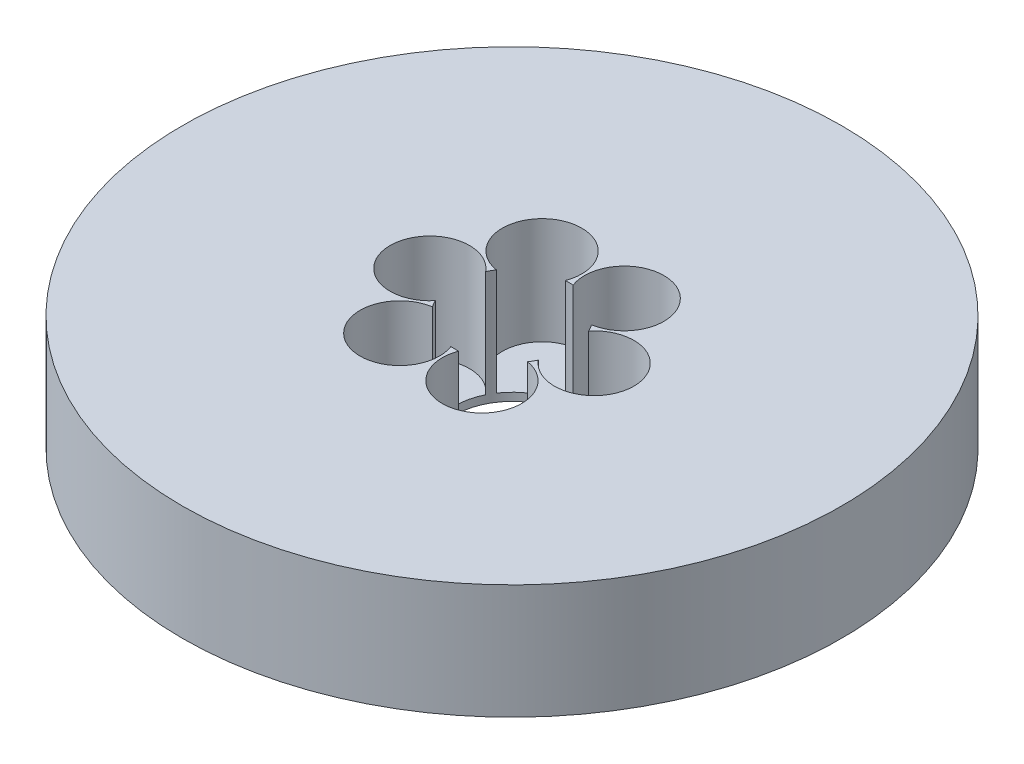
ISO-10303-21;
HEADER;
FILE_DESCRIPTION(('STEP AP214'),'2;1');
FILE_NAME('part.step','',(''),(''),'','','');
FILE_SCHEMA(('AUTOMOTIVE_DESIGN { 1 0 10303 214 1 1 1 1 }'));
ENDSEC;
DATA;
#1=APPLICATION_CONTEXT('core data for automotive mechanical design processes');
#2=APPLICATION_PROTOCOL_DEFINITION('international standard','automotive_design',2000,#1);
#3=PRODUCT_CONTEXT('',#1,'mechanical');
#4=PRODUCT('Part','Part','',(#3));
#5=PRODUCT_RELATED_PRODUCT_CATEGORY('part','',(#4));
#6=PRODUCT_DEFINITION_FORMATION('','',#4);
#7=PRODUCT_DEFINITION_CONTEXT('part definition',#1,'design');
#8=PRODUCT_DEFINITION('design','',#6,#7);
#9=PRODUCT_DEFINITION_SHAPE('','',#8);
#10=(LENGTH_UNIT() NAMED_UNIT(*) SI_UNIT(.MILLI.,.METRE.));
#11=(NAMED_UNIT(*) PLANE_ANGLE_UNIT() SI_UNIT($,.RADIAN.));
#12=(NAMED_UNIT(*) SI_UNIT($,.STERADIAN.) SOLID_ANGLE_UNIT());
#13=UNCERTAINTY_MEASURE_WITH_UNIT(LENGTH_MEASURE(1.E-05),#10,'distance_accuracy_value','');
#14=(GEOMETRIC_REPRESENTATION_CONTEXT(3) GLOBAL_UNCERTAINTY_ASSIGNED_CONTEXT((#13)) GLOBAL_UNIT_ASSIGNED_CONTEXT((#10,
#11,#12)) REPRESENTATION_CONTEXT('',''));
#15=CARTESIAN_POINT('',(0.,0.,0.));
#16=DIRECTION('',(0.,0.,1.));
#17=DIRECTION('',(1.,0.,0.));
#18=AXIS2_PLACEMENT_3D('',#15,#16,#17);
#19=CARTESIAN_POINT('',(0.,20.,0.));
#20=DIRECTION('',(0.,-1.,0.));
#21=DIRECTION('',(0.,0.,-1.));
#22=AXIS2_PLACEMENT_3D('',#19,#20,#21);
#23=CYLINDRICAL_SURFACE('',#22,57.5);
#24=CARTESIAN_POINT('',(0.,20.,0.));
#25=DIRECTION('',(0.,1.,0.));
#26=DIRECTION('',(0.,0.,1.));
#27=AXIS2_PLACEMENT_3D('',#24,#25,#26);
#28=CIRCLE('',#27,57.5);
#29=CARTESIAN_POINT('',(0.,20.,57.5));
#30=VERTEX_POINT('',#29);
#31=EDGE_CURVE('E168',#30,#30,#28,.T.);
#32=ORIENTED_EDGE('',*,*,#31,.F.);
#33=EDGE_LOOP('',(#32));
#34=FACE_BOUND('',#33,.T.);
#35=CARTESIAN_POINT('',(0.,0.,0.));
#36=DIRECTION('',(0.,1.,0.));
#37=DIRECTION('',(0.,0.,1.));
#38=AXIS2_PLACEMENT_3D('',#35,#36,#37);
#39=CIRCLE('',#38,57.5);
#40=CARTESIAN_POINT('',(0.,0.,57.5));
#41=VERTEX_POINT('',#40);
#42=EDGE_CURVE('E158',#41,#41,#39,.T.);
#43=ORIENTED_EDGE('',*,*,#42,.T.);
#44=EDGE_LOOP('',(#43));
#45=FACE_BOUND('',#44,.T.);
#46=ADVANCED_FACE('F39',(#34,#45),#23,.T.);
#47=CARTESIAN_POINT('',(0.,20.,0.));
#48=DIRECTION('',(0.,1.,0.));
#49=DIRECTION('',(0.,0.,1.));
#50=AXIS2_PLACEMENT_3D('',#47,#48,#49);
#51=PLANE('',#50);
#52=CARTESIAN_POINT('',(14.3354619955634,20.,0.));
#53=DIRECTION('',(0.,1.,0.));
#54=DIRECTION('',(0.,0.,-1.));
#55=AXIS2_PLACEMENT_3D('',#52,#53,#54);
#56=CIRCLE('',#55,6.92812453102638);
#57=CARTESIAN_POINT('',(8.98145316797351,20.,4.39698749048693));
#58=VERTEX_POINT('',#57);
#59=CARTESIAN_POINT('',(8.98145316797351,20.,-4.39698749048693));
#60=VERTEX_POINT('',#59);
#61=EDGE_CURVE('E212',#58,#60,#56,.T.);
#62=ORIENTED_EDGE('',*,*,#61,.F.);
#63=CARTESIAN_POINT('',(0.,20.,0.));
#64=DIRECTION('',(0.,1.,0.));
#65=DIRECTION('',(0.,0.,1.));
#66=AXIS2_PLACEMENT_3D('',#63,#64,#65);
#67=CIRCLE('',#66,10.);
#68=CARTESIAN_POINT('',(8.29862945087085,20.,5.57967286112178));
#69=VERTEX_POINT('',#68);
#70=EDGE_CURVE('E156',#69,#58,#67,.T.);
#71=ORIENTED_EDGE('',*,*,#70,.F.);
#72=CARTESIAN_POINT('',(7.16773099778178,20.,12.4148742631443));
#73=DIRECTION('',(0.,1.,0.));
#74=DIRECTION('',(0.866025403784436,0.,-0.500000000000004));
#75=AXIS2_PLACEMENT_3D('',#72,#73,#74);
#76=CIRCLE('',#75,6.92812453102638);
#77=CARTESIAN_POINT('',(0.682823717102737,20.,9.97666035160875));
#78=VERTEX_POINT('',#77);
#79=EDGE_CURVE('E152',#78,#69,#76,.T.);
#80=ORIENTED_EDGE('',*,*,#79,.F.);
#81=CARTESIAN_POINT('',(-0.682823717102664,20.,9.97666035160875));
#82=VERTEX_POINT('',#81);
#83=EDGE_CURVE('E148',#82,#78,#67,.T.);
#84=ORIENTED_EDGE('',*,*,#83,.F.);
#85=CARTESIAN_POINT('',(-7.16773099778169,20.,12.4148742631443));
#86=DIRECTION('',(0.,1.,0.));
#87=DIRECTION('',(0.86602540378444,0.,0.499999999999998));
#88=AXIS2_PLACEMENT_3D('',#85,#86,#87);
#89=CIRCLE('',#88,6.92812453102638);
#90=CARTESIAN_POINT('',(-8.29862945087081,20.,5.57967286112184));
#91=VERTEX_POINT('',#90);
#92=EDGE_CURVE('E127',#91,#82,#89,.T.);
#93=ORIENTED_EDGE('',*,*,#92,.F.);
#94=CARTESIAN_POINT('',(-8.98145316797351,20.,4.39698749048693));
#95=VERTEX_POINT('',#94);
#96=EDGE_CURVE('E154',#95,#91,#67,.T.);
#97=ORIENTED_EDGE('',*,*,#96,.F.);
#98=CARTESIAN_POINT('',(-14.3354619955634,20.,0.));
#99=DIRECTION('',(0.,1.,0.));
#100=DIRECTION('',(0.,0.,1.));
#101=AXIS2_PLACEMENT_3D('',#98,#99,#100);
#102=CIRCLE('',#101,6.92812453102638);
#103=CARTESIAN_POINT('',(-8.98145316797351,20.,-4.39698749048693));
#104=VERTEX_POINT('',#103);
#105=EDGE_CURVE('E163',#104,#95,#102,.T.);
#106=ORIENTED_EDGE('',*,*,#105,.F.);
#107=CARTESIAN_POINT('',(-8.29862945087089,20.,-5.57967286112173));
#108=VERTEX_POINT('',#107);
#109=EDGE_CURVE('E157',#108,#104,#67,.T.);
#110=ORIENTED_EDGE('',*,*,#109,.F.);
#111=CARTESIAN_POINT('',(-7.16773099778187,20.,-12.4148742631442));
#112=DIRECTION('',(0.,1.,0.));
#113=DIRECTION('',(-0.866025403784433,0.,0.50000000000001));
#114=AXIS2_PLACEMENT_3D('',#111,#112,#113);
#115=CIRCLE('',#114,6.92812453102638);
#116=CARTESIAN_POINT('',(-0.682823717102803,20.,-9.97666035160874));
#117=VERTEX_POINT('',#116);
#118=EDGE_CURVE('E371',#117,#108,#115,.T.);
#119=ORIENTED_EDGE('',*,*,#118,.F.);
#120=CARTESIAN_POINT('',(0.682823717102592,20.,-9.97666035160876));
#121=VERTEX_POINT('',#120);
#122=EDGE_CURVE('E378',#121,#117,#67,.T.);
#123=ORIENTED_EDGE('',*,*,#122,.F.);
#124=CARTESIAN_POINT('',(7.16773099778161,20.,-12.4148742631444));
#125=DIRECTION('',(0.,1.,0.));
#126=DIRECTION('',(-0.866025403784443,0.,-0.499999999999992));
#127=AXIS2_PLACEMENT_3D('',#124,#125,#126);
#128=CIRCLE('',#127,6.92812453102638);
#129=CARTESIAN_POINT('',(8.29862945087078,20.,-5.5796728611219));
#130=VERTEX_POINT('',#129);
#131=EDGE_CURVE('E392',#130,#121,#128,.T.);
#132=ORIENTED_EDGE('',*,*,#131,.F.);
#133=EDGE_CURVE('E161',#60,#130,#67,.T.);
#134=ORIENTED_EDGE('',*,*,#133,.F.);
#135=EDGE_LOOP('',(#62,#71,#80,#84,#93,#97,#106,#110,#119,#123,#132,#134));
#136=FACE_BOUND('',#135,.T.);
#137=ORIENTED_EDGE('',*,*,#31,.T.);
#138=EDGE_LOOP('',(#137));
#139=FACE_BOUND('',#138,.T.);
#140=ADVANCED_FACE('F151',(#136,#139),#51,.T.);
#141=CARTESIAN_POINT('',(0.,0.,0.));
#142=DIRECTION('',(0.,1.,0.));
#143=DIRECTION('',(0.,0.,1.));
#144=AXIS2_PLACEMENT_3D('',#141,#142,#143);
#145=PLANE('',#144);
#146=CARTESIAN_POINT('',(0.,0.,0.));
#147=DIRECTION('',(0.,1.,0.));
#148=DIRECTION('',(0.,0.,1.));
#149=AXIS2_PLACEMENT_3D('',#146,#147,#148);
#150=CIRCLE('',#149,10.);
#151=CARTESIAN_POINT('',(0.,0.,10.));
#152=VERTEX_POINT('',#151);
#153=EDGE_CURVE('E167',#152,#152,#150,.T.);
#154=ORIENTED_EDGE('',*,*,#153,.T.);
#155=EDGE_LOOP('',(#154));
#156=FACE_BOUND('',#155,.T.);
#157=ORIENTED_EDGE('',*,*,#42,.F.);
#158=EDGE_LOOP('',(#157));
#159=FACE_BOUND('',#158,.T.);
#160=ADVANCED_FACE('F235',(#156,#159),#145,.F.);
#161=CARTESIAN_POINT('',(0.,20.,0.));
#162=DIRECTION('',(0.,-1.,0.));
#163=DIRECTION('',(0.,0.,-1.));
#164=AXIS2_PLACEMENT_3D('',#161,#162,#163);
#165=CYLINDRICAL_SURFACE('',#164,10.);
#166=DIRECTION('',(0.,1.,0.));
#167=VECTOR('',#166,1.);
#168=CARTESIAN_POINT('',(8.98145316797351,10.6944946433437,4.39698749048693));
#169=LINE('',#168,#167);
#170=CARTESIAN_POINT('',(8.98145316797351,1.38898928668748,4.39698749048693));
#171=VERTEX_POINT('',#170);
#172=EDGE_CURVE('E11',#171,#58,#169,.T.);
#173=ORIENTED_EDGE('',*,*,#172,.F.);
#174=CARTESIAN_POINT('',(0.,1.38898928668748,0.));
#175=DIRECTION('',(0.,1.,0.));
#176=DIRECTION('',(0.,0.,1.));
#177=AXIS2_PLACEMENT_3D('',#174,#175,#176);
#178=CIRCLE('',#177,10.);
#179=CARTESIAN_POINT('',(8.98145316797351,1.38898928668748,-4.39698749048693));
#180=VERTEX_POINT('',#179);
#181=EDGE_CURVE('E207',#171,#180,#178,.T.);
#182=ORIENTED_EDGE('',*,*,#181,.T.);
#183=DIRECTION('',(0.,1.,0.));
#184=VECTOR('',#183,1.);
#185=CARTESIAN_POINT('',(8.98145316797351,10.6944946433437,-4.39698749048693));
#186=LINE('',#185,#184);
#187=EDGE_CURVE('E46',#60,#180,#186,.F.);
#188=ORIENTED_EDGE('',*,*,#187,.F.);
#189=ORIENTED_EDGE('',*,*,#133,.T.);
#190=DIRECTION('',(0.,1.,0.));
#191=VECTOR('',#190,1.);
#192=CARTESIAN_POINT('',(8.29862945087078,10.6944946433437,-5.5796728611219));
#193=LINE('',#192,#191);
#194=CARTESIAN_POINT('',(8.29862945087078,1.38898928668748,-5.5796728611219));
#195=VERTEX_POINT('',#194);
#196=EDGE_CURVE('E199',#195,#130,#193,.T.);
#197=ORIENTED_EDGE('',*,*,#196,.F.);
#198=CARTESIAN_POINT('',(0.,1.38898928668748,0.));
#199=DIRECTION('',(0.,1.,0.));
#200=DIRECTION('',(0.,0.,1.));
#201=AXIS2_PLACEMENT_3D('',#198,#199,#200);
#202=CIRCLE('',#201,10.);
#203=CARTESIAN_POINT('',(0.682823717102592,1.38898928668748,-9.97666035160876));
#204=VERTEX_POINT('',#203);
#205=EDGE_CURVE('E193',#195,#204,#202,.T.);
#206=ORIENTED_EDGE('',*,*,#205,.T.);
#207=DIRECTION('',(0.,1.,0.));
#208=VECTOR('',#207,1.);
#209=CARTESIAN_POINT('',(0.682823717102593,10.6944946433437,-9.97666035160876));
#210=LINE('',#209,#208);
#211=EDGE_CURVE('E197',#121,#204,#210,.F.);
#212=ORIENTED_EDGE('',*,*,#211,.F.);
#213=ORIENTED_EDGE('',*,*,#122,.T.);
#214=DIRECTION('',(0.,1.,0.));
#215=VECTOR('',#214,1.);
#216=CARTESIAN_POINT('',(-0.682823717102804,10.6944946433437,-9.97666035160874));
#217=LINE('',#216,#215);
#218=CARTESIAN_POINT('',(-0.682823717102803,1.38898928668748,-9.97666035160874));
#219=VERTEX_POINT('',#218);
#220=EDGE_CURVE('E195',#219,#117,#217,.T.);
#221=ORIENTED_EDGE('',*,*,#220,.F.);
#222=CARTESIAN_POINT('',(0.,1.38898928668748,0.));
#223=DIRECTION('',(0.,1.,0.));
#224=DIRECTION('',(0.,0.,1.));
#225=AXIS2_PLACEMENT_3D('',#222,#223,#224);
#226=CIRCLE('',#225,10.);
#227=CARTESIAN_POINT('',(-8.29862945087089,1.38898928668748,-5.57967286112173));
#228=VERTEX_POINT('',#227);
#229=EDGE_CURVE('E186',#219,#228,#226,.T.);
#230=ORIENTED_EDGE('',*,*,#229,.T.);
#231=DIRECTION('',(0.,1.,0.));
#232=VECTOR('',#231,1.);
#233=CARTESIAN_POINT('',(-8.29862945087089,10.6944946433437,-5.57967286112173));
#234=LINE('',#233,#232);
#235=EDGE_CURVE('E188',#108,#228,#234,.F.);
#236=ORIENTED_EDGE('',*,*,#235,.F.);
#237=ORIENTED_EDGE('',*,*,#109,.T.);
#238=DIRECTION('',(0.,1.,0.));
#239=VECTOR('',#238,1.);
#240=CARTESIAN_POINT('',(-8.98145316797351,10.6944946433437,-4.39698749048693));
#241=LINE('',#240,#239);
#242=CARTESIAN_POINT('',(-8.98145316797351,1.38898928668748,-4.39698749048693));
#243=VERTEX_POINT('',#242);
#244=EDGE_CURVE('E182',#243,#104,#241,.T.);
#245=ORIENTED_EDGE('',*,*,#244,.F.);
#246=CARTESIAN_POINT('',(0.,1.38898928668748,0.));
#247=DIRECTION('',(0.,1.,0.));
#248=DIRECTION('',(0.,0.,1.));
#249=AXIS2_PLACEMENT_3D('',#246,#247,#248);
#250=CIRCLE('',#249,10.);
#251=CARTESIAN_POINT('',(-8.98145316797351,1.38898928668748,4.39698749048693));
#252=VERTEX_POINT('',#251);
#253=EDGE_CURVE('E172',#243,#252,#250,.T.);
#254=ORIENTED_EDGE('',*,*,#253,.T.);
#255=DIRECTION('',(0.,1.,0.));
#256=VECTOR('',#255,1.);
#257=CARTESIAN_POINT('',(-8.98145316797351,10.6944946433437,4.39698749048693));
#258=LINE('',#257,#256);
#259=EDGE_CURVE('E177',#95,#252,#258,.F.);
#260=ORIENTED_EDGE('',*,*,#259,.F.);
#261=ORIENTED_EDGE('',*,*,#96,.T.);
#262=DIRECTION('',(0.,1.,0.));
#263=VECTOR('',#262,1.);
#264=CARTESIAN_POINT('',(-8.29862945087081,10.6944946433437,5.57967286112184));
#265=LINE('',#264,#263);
#266=CARTESIAN_POINT('',(-8.29862945087081,1.38898928668748,5.57967286112184));
#267=VERTEX_POINT('',#266);
#268=EDGE_CURVE('E132',#267,#91,#265,.T.);
#269=ORIENTED_EDGE('',*,*,#268,.F.);
#270=CARTESIAN_POINT('',(0.,1.38898928668748,0.));
#271=DIRECTION('',(0.,1.,0.));
#272=DIRECTION('',(0.,0.,1.));
#273=AXIS2_PLACEMENT_3D('',#270,#271,#272);
#274=CIRCLE('',#273,10.);
#275=CARTESIAN_POINT('',(-0.682823717102664,1.38898928668748,9.97666035160875));
#276=VERTEX_POINT('',#275);
#277=EDGE_CURVE('E150',#267,#276,#274,.T.);
#278=ORIENTED_EDGE('',*,*,#277,.T.);
#279=DIRECTION('',(0.,1.,0.));
#280=VECTOR('',#279,1.);
#281=CARTESIAN_POINT('',(-0.682823717102664,10.6944946433437,9.97666035160875));
#282=LINE('',#281,#280);
#283=EDGE_CURVE('E128',#82,#276,#282,.F.);
#284=ORIENTED_EDGE('',*,*,#283,.F.);
#285=ORIENTED_EDGE('',*,*,#83,.T.);
#286=DIRECTION('',(0.,1.,0.));
#287=VECTOR('',#286,1.);
#288=CARTESIAN_POINT('',(0.682823717102736,10.6944946433437,9.97666035160875));
#289=LINE('',#288,#287);
#290=CARTESIAN_POINT('',(0.682823717102737,1.38898928668748,9.97666035160875));
#291=VERTEX_POINT('',#290);
#292=EDGE_CURVE('E210',#291,#78,#289,.T.);
#293=ORIENTED_EDGE('',*,*,#292,.F.);
#294=CARTESIAN_POINT('',(0.,1.38898928668748,0.));
#295=DIRECTION('',(0.,1.,0.));
#296=DIRECTION('',(0.,0.,1.));
#297=AXIS2_PLACEMENT_3D('',#294,#295,#296);
#298=CIRCLE('',#297,10.);
#299=CARTESIAN_POINT('',(8.29862945087085,1.38898928668748,5.57967286112178));
#300=VERTEX_POINT('',#299);
#301=EDGE_CURVE('E205',#291,#300,#298,.T.);
#302=ORIENTED_EDGE('',*,*,#301,.T.);
#303=DIRECTION('',(0.,1.,0.));
#304=VECTOR('',#303,1.);
#305=CARTESIAN_POINT('',(8.29862945087085,10.6944946433437,5.57967286112179));
#306=LINE('',#305,#304);
#307=EDGE_CURVE('E202',#69,#300,#306,.F.);
#308=ORIENTED_EDGE('',*,*,#307,.F.);
#309=ORIENTED_EDGE('',*,*,#70,.T.);
#310=EDGE_LOOP('',(#173,#182,#188,#189,#197,#206,#212,#213,#221,#230,#236,#237,#245,#254,#260,
#261,#269,#278,#284,#285,#293,#302,#308,#309));
#311=FACE_BOUND('',#310,.T.);
#312=ORIENTED_EDGE('',*,*,#153,.F.);
#313=EDGE_LOOP('',(#312));
#314=FACE_BOUND('',#313,.T.);
#315=ADVANCED_FACE('F141',(#311,#314),#165,.F.);
#316=CARTESIAN_POINT('',(-14.3354619955634,1.38898928668748,0.));
#317=DIRECTION('',(0.,1.,0.));
#318=DIRECTION('',(0.,0.,1.));
#319=AXIS2_PLACEMENT_3D('',#316,#317,#318);
#320=CYLINDRICAL_SURFACE('',#319,6.92812453102638);
#321=ORIENTED_EDGE('',*,*,#244,.T.);
#322=ORIENTED_EDGE('',*,*,#105,.T.);
#323=ORIENTED_EDGE('',*,*,#259,.T.);
#324=CARTESIAN_POINT('',(-14.3354619955634,1.38898928668748,0.));
#325=DIRECTION('',(0.,1.,0.));
#326=DIRECTION('',(0.,0.,1.));
#327=AXIS2_PLACEMENT_3D('',#324,#325,#326);
#328=CIRCLE('',#327,6.92812453102638);
#329=EDGE_CURVE('E166',#243,#252,#328,.T.);
#330=ORIENTED_EDGE('',*,*,#329,.F.);
#331=EDGE_LOOP('',(#321,#322,#323,#330));
#332=FACE_BOUND('',#331,.T.);
#333=ADVANCED_FACE('F242',(#332),#320,.F.);
#334=CARTESIAN_POINT('',(-14.3354619955634,1.38898928668748,0.));
#335=DIRECTION('',(0.,1.,0.));
#336=DIRECTION('',(0.,0.,1.));
#337=AXIS2_PLACEMENT_3D('',#334,#335,#336);
#338=PLANE('',#337);
#339=ORIENTED_EDGE('',*,*,#329,.T.);
#340=ORIENTED_EDGE('',*,*,#253,.F.);
#341=EDGE_LOOP('',(#339,#340));
#342=FACE_BOUND('',#341,.T.);
#343=ADVANCED_FACE('F250',(#342),#338,.T.);
#344=CARTESIAN_POINT('',(-7.16773099778169,1.38898928668748,12.4148742631443));
#345=DIRECTION('',(0.,1.,0.));
#346=DIRECTION('',(0.,0.,1.));
#347=AXIS2_PLACEMENT_3D('',#344,#345,#346);
#348=CYLINDRICAL_SURFACE('',#347,6.92812453102638);
#349=ORIENTED_EDGE('',*,*,#268,.T.);
#350=ORIENTED_EDGE('',*,*,#92,.T.);
#351=ORIENTED_EDGE('',*,*,#283,.T.);
#352=CARTESIAN_POINT('',(-7.16773099778169,1.38898928668748,12.4148742631443));
#353=DIRECTION('',(0.,1.,0.));
#354=DIRECTION('',(0.86602540378444,0.,0.499999999999998));
#355=AXIS2_PLACEMENT_3D('',#352,#353,#354);
#356=CIRCLE('',#355,6.92812453102638);
#357=EDGE_CURVE('E137',#267,#276,#356,.T.);
#358=ORIENTED_EDGE('',*,*,#357,.F.);
#359=EDGE_LOOP('',(#349,#350,#351,#358));
#360=FACE_BOUND('',#359,.T.);
#361=ADVANCED_FACE('F126',(#360),#348,.F.);
#362=CARTESIAN_POINT('',(-7.16773099778169,1.38898928668748,12.4148742631443));
#363=DIRECTION('',(0.,1.,0.));
#364=DIRECTION('',(0.86602540378444,0.,0.499999999999998));
#365=AXIS2_PLACEMENT_3D('',#362,#363,#364);
#366=PLANE('',#365);
#367=ORIENTED_EDGE('',*,*,#357,.T.);
#368=ORIENTED_EDGE('',*,*,#277,.F.);
#369=EDGE_LOOP('',(#367,#368));
#370=FACE_BOUND('',#369,.T.);
#371=ADVANCED_FACE('F255',(#370),#366,.T.);
#372=CARTESIAN_POINT('',(-7.16773099778187,1.38898928668748,-12.4148742631442));
#373=DIRECTION('',(0.,1.,0.));
#374=DIRECTION('',(0.,0.,1.));
#375=AXIS2_PLACEMENT_3D('',#372,#373,#374);
#376=CYLINDRICAL_SURFACE('',#375,6.92812453102638);
#377=ORIENTED_EDGE('',*,*,#220,.T.);
#378=ORIENTED_EDGE('',*,*,#118,.T.);
#379=ORIENTED_EDGE('',*,*,#235,.T.);
#380=CARTESIAN_POINT('',(-7.16773099778187,1.38898928668748,-12.4148742631442));
#381=DIRECTION('',(0.,1.,0.));
#382=DIRECTION('',(-0.866025403784433,0.,0.50000000000001));
#383=AXIS2_PLACEMENT_3D('',#380,#381,#382);
#384=CIRCLE('',#383,6.92812453102638);
#385=EDGE_CURVE('E373',#219,#228,#384,.T.);
#386=ORIENTED_EDGE('',*,*,#385,.F.);
#387=EDGE_LOOP('',(#377,#378,#379,#386));
#388=FACE_BOUND('',#387,.T.);
#389=ADVANCED_FACE('F260',(#388),#376,.F.);
#390=CARTESIAN_POINT('',(-7.16773099778187,1.38898928668748,-12.4148742631442));
#391=DIRECTION('',(0.,1.,0.));
#392=DIRECTION('',(-0.866025403784433,0.,0.50000000000001));
#393=AXIS2_PLACEMENT_3D('',#390,#391,#392);
#394=PLANE('',#393);
#395=ORIENTED_EDGE('',*,*,#385,.T.);
#396=ORIENTED_EDGE('',*,*,#229,.F.);
#397=EDGE_LOOP('',(#395,#396));
#398=FACE_BOUND('',#397,.T.);
#399=ADVANCED_FACE('F301',(#398),#394,.T.);
#400=CARTESIAN_POINT('',(7.16773099778161,1.38898928668748,-12.4148742631444));
#401=DIRECTION('',(0.,1.,0.));
#402=DIRECTION('',(0.,0.,1.));
#403=AXIS2_PLACEMENT_3D('',#400,#401,#402);
#404=CYLINDRICAL_SURFACE('',#403,6.92812453102638);
#405=ORIENTED_EDGE('',*,*,#196,.T.);
#406=ORIENTED_EDGE('',*,*,#131,.T.);
#407=ORIENTED_EDGE('',*,*,#211,.T.);
#408=CARTESIAN_POINT('',(7.16773099778161,1.38898928668748,-12.4148742631444));
#409=DIRECTION('',(0.,1.,0.));
#410=DIRECTION('',(-0.866025403784443,0.,-0.499999999999992));
#411=AXIS2_PLACEMENT_3D('',#408,#409,#410);
#412=CIRCLE('',#411,6.92812453102638);
#413=EDGE_CURVE('E388',#195,#204,#412,.T.);
#414=ORIENTED_EDGE('',*,*,#413,.F.);
#415=EDGE_LOOP('',(#405,#406,#407,#414));
#416=FACE_BOUND('',#415,.T.);
#417=ADVANCED_FACE('F295',(#416),#404,.F.);
#418=CARTESIAN_POINT('',(7.16773099778161,1.38898928668748,-12.4148742631444));
#419=DIRECTION('',(0.,1.,0.));
#420=DIRECTION('',(-0.866025403784443,0.,-0.499999999999992));
#421=AXIS2_PLACEMENT_3D('',#418,#419,#420);
#422=PLANE('',#421);
#423=ORIENTED_EDGE('',*,*,#413,.T.);
#424=ORIENTED_EDGE('',*,*,#205,.F.);
#425=EDGE_LOOP('',(#423,#424));
#426=FACE_BOUND('',#425,.T.);
#427=ADVANCED_FACE('F265',(#426),#422,.T.);
#428=CARTESIAN_POINT('',(7.16773099778178,1.38898928668748,12.4148742631443));
#429=DIRECTION('',(0.,1.,0.));
#430=DIRECTION('',(0.,0.,1.));
#431=AXIS2_PLACEMENT_3D('',#428,#429,#430);
#432=CYLINDRICAL_SURFACE('',#431,6.92812453102638);
#433=ORIENTED_EDGE('',*,*,#292,.T.);
#434=ORIENTED_EDGE('',*,*,#79,.T.);
#435=ORIENTED_EDGE('',*,*,#307,.T.);
#436=CARTESIAN_POINT('',(7.16773099778178,1.38898928668748,12.4148742631443));
#437=DIRECTION('',(0.,1.,0.));
#438=DIRECTION('',(0.866025403784436,0.,-0.500000000000004));
#439=AXIS2_PLACEMENT_3D('',#436,#437,#438);
#440=CIRCLE('',#439,6.92812453102638);
#441=EDGE_CURVE('E56',#291,#300,#440,.T.);
#442=ORIENTED_EDGE('',*,*,#441,.F.);
#443=EDGE_LOOP('',(#433,#434,#435,#442));
#444=FACE_BOUND('',#443,.T.);
#445=ADVANCED_FACE('F259',(#444),#432,.F.);
#446=CARTESIAN_POINT('',(7.16773099778178,1.38898928668748,12.4148742631443));
#447=DIRECTION('',(0.,1.,0.));
#448=DIRECTION('',(0.866025403784436,0.,-0.500000000000004));
#449=AXIS2_PLACEMENT_3D('',#446,#447,#448);
#450=PLANE('',#449);
#451=ORIENTED_EDGE('',*,*,#441,.T.);
#452=ORIENTED_EDGE('',*,*,#301,.F.);
#453=EDGE_LOOP('',(#451,#452));
#454=FACE_BOUND('',#453,.T.);
#455=ADVANCED_FACE('F224',(#454),#450,.T.);
#456=CARTESIAN_POINT('',(14.3354619955634,1.38898928668748,0.));
#457=DIRECTION('',(0.,1.,0.));
#458=DIRECTION('',(0.,0.,1.));
#459=AXIS2_PLACEMENT_3D('',#456,#457,#458);
#460=CYLINDRICAL_SURFACE('',#459,6.92812453102638);
#461=ORIENTED_EDGE('',*,*,#172,.T.);
#462=ORIENTED_EDGE('',*,*,#61,.T.);
#463=ORIENTED_EDGE('',*,*,#187,.T.);
#464=CARTESIAN_POINT('',(14.3354619955634,1.38898928668748,0.));
#465=DIRECTION('',(0.,1.,0.));
#466=DIRECTION('',(0.,0.,-1.));
#467=AXIS2_PLACEMENT_3D('',#464,#465,#466);
#468=CIRCLE('',#467,6.92812453102638);
#469=EDGE_CURVE('E55',#171,#180,#468,.T.);
#470=ORIENTED_EDGE('',*,*,#469,.F.);
#471=EDGE_LOOP('',(#461,#462,#463,#470));
#472=FACE_BOUND('',#471,.T.);
#473=ADVANCED_FACE('F213',(#472),#460,.F.);
#474=CARTESIAN_POINT('',(14.3354619955634,1.38898928668748,0.));
#475=DIRECTION('',(0.,1.,0.));
#476=DIRECTION('',(0.,0.,-1.));
#477=AXIS2_PLACEMENT_3D('',#474,#475,#476);
#478=PLANE('',#477);
#479=ORIENTED_EDGE('',*,*,#469,.T.);
#480=ORIENTED_EDGE('',*,*,#181,.F.);
#481=EDGE_LOOP('',(#479,#480));
#482=FACE_BOUND('',#481,.T.);
#483=ADVANCED_FACE('F220',(#482),#478,.T.);
#484=CLOSED_SHELL('',(#46,#140,#160,#315,#333,#343,#361,#371,#389,#399,#417,#427,#445,#455,#473,#483));
#485=MANIFOLD_SOLID_BREP('B2',#484);
#486=ADVANCED_BREP_SHAPE_REPRESENTATION('',(#18,#485),#14);
#487=SHAPE_DEFINITION_REPRESENTATION(#9,#486);
ENDSEC;
END-ISO-10303-21;
